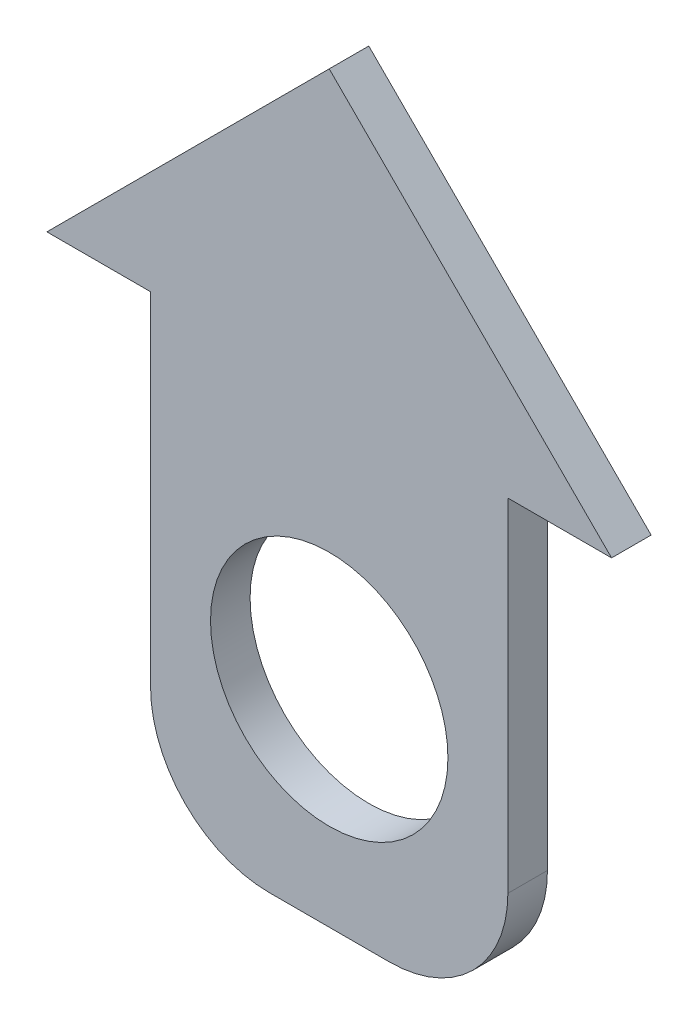
ISO-10303-21;
HEADER;
FILE_DESCRIPTION(('STEP AP214'),'2;1');
FILE_NAME('part.step','',(''),(''),'','','');
FILE_SCHEMA(('AUTOMOTIVE_DESIGN { 1 0 10303 214 1 1 1 1 }'));
ENDSEC;
DATA;
#1=APPLICATION_CONTEXT('core data for automotive mechanical design processes');
#2=APPLICATION_PROTOCOL_DEFINITION('international standard','automotive_design',2000,#1);
#3=PRODUCT_CONTEXT('',#1,'mechanical');
#4=PRODUCT('Part','Part','',(#3));
#5=PRODUCT_RELATED_PRODUCT_CATEGORY('part','',(#4));
#6=PRODUCT_DEFINITION_FORMATION('','',#4);
#7=PRODUCT_DEFINITION_CONTEXT('part definition',#1,'design');
#8=PRODUCT_DEFINITION('design','',#6,#7);
#9=PRODUCT_DEFINITION_SHAPE('','',#8);
#10=(LENGTH_UNIT() NAMED_UNIT(*) SI_UNIT(.MILLI.,.METRE.));
#11=(NAMED_UNIT(*) PLANE_ANGLE_UNIT() SI_UNIT($,.RADIAN.));
#12=(NAMED_UNIT(*) SI_UNIT($,.STERADIAN.) SOLID_ANGLE_UNIT());
#13=UNCERTAINTY_MEASURE_WITH_UNIT(LENGTH_MEASURE(1.E-05),#10,'distance_accuracy_value','');
#14=(GEOMETRIC_REPRESENTATION_CONTEXT(3) GLOBAL_UNCERTAINTY_ASSIGNED_CONTEXT((#13)) GLOBAL_UNIT_ASSIGNED_CONTEXT((#10,
#11,#12)) REPRESENTATION_CONTEXT('',''));
#15=CARTESIAN_POINT('',(0.,0.,0.));
#16=DIRECTION('',(0.,0.,1.));
#17=DIRECTION('',(1.,0.,0.));
#18=AXIS2_PLACEMENT_3D('',#15,#16,#17);
#19=CARTESIAN_POINT('',(0.,0.,1.));
#20=DIRECTION('',(0.,0.,-1.));
#21=DIRECTION('',(-1.,0.,0.));
#22=AXIS2_PLACEMENT_3D('',#19,#20,#21);
#23=PLANE('',#22);
#24=DIRECTION('',(0.,-1.,0.));
#25=VECTOR('',#24,1.);
#26=CARTESIAN_POINT('',(-4.51505590680133,6.44279873715326,1.));
#27=LINE('',#26,#25);
#28=CARTESIAN_POINT('',(-4.51505590680133,6.44279873715326,1.));
#29=VERTEX_POINT('',#28);
#30=CARTESIAN_POINT('',(-4.51505590680133,-2.20796863492381,1.));
#31=VERTEX_POINT('',#30);
#32=EDGE_CURVE('E185',#29,#31,#27,.T.);
#33=ORIENTED_EDGE('',*,*,#32,.T.);
#34=CARTESIAN_POINT('',(-1.51505590680133,-2.20796863492381,1.));
#35=DIRECTION('',(0.,0.,-1.));
#36=DIRECTION('',(-1.,0.,0.));
#37=AXIS2_PLACEMENT_3D('',#34,#35,#36);
#38=CIRCLE('',#37,3.);
#39=CARTESIAN_POINT('',(-1.51505590680133,-5.20796863492381,1.));
#40=VERTEX_POINT('',#39);
#41=EDGE_CURVE('E45',#31,#40,#38,.F.);
#42=ORIENTED_EDGE('',*,*,#41,.T.);
#43=DIRECTION('',(1.,0.,0.));
#44=VECTOR('',#43,1.);
#45=CARTESIAN_POINT('',(-4.51505590680133,-5.20796863492381,1.));
#46=LINE('',#45,#44);
#47=CARTESIAN_POINT('',(1.51505590680133,-5.20796863492381,1.));
#48=VERTEX_POINT('',#47);
#49=EDGE_CURVE('E188',#40,#48,#46,.T.);
#50=ORIENTED_EDGE('',*,*,#49,.T.);
#51=CARTESIAN_POINT('',(1.51505590680133,-2.20796863492381,1.));
#52=DIRECTION('',(0.,0.,-1.));
#53=DIRECTION('',(-1.,0.,0.));
#54=AXIS2_PLACEMENT_3D('',#51,#52,#53);
#55=CIRCLE('',#54,3.);
#56=CARTESIAN_POINT('',(4.51505590680133,-2.20796863492381,1.));
#57=VERTEX_POINT('',#56);
#58=EDGE_CURVE('E60',#48,#57,#55,.F.);
#59=ORIENTED_EDGE('',*,*,#58,.T.);
#60=DIRECTION('',(0.,1.,0.));
#61=VECTOR('',#60,1.);
#62=CARTESIAN_POINT('',(4.51505590680133,-5.20796863492381,1.));
#63=LINE('',#62,#61);
#64=CARTESIAN_POINT('',(4.51505590680133,6.44279873715319,1.));
#65=VERTEX_POINT('',#64);
#66=EDGE_CURVE('E174',#57,#65,#63,.T.);
#67=ORIENTED_EDGE('',*,*,#66,.T.);
#68=DIRECTION('',(1.,0.,0.));
#69=VECTOR('',#68,1.);
#70=CARTESIAN_POINT('',(4.51505590680133,6.44279873715319,1.));
#71=LINE('',#70,#69);
#72=CARTESIAN_POINT('',(7.13571146527562,6.44279873715319,1.));
#73=VERTEX_POINT('',#72);
#74=EDGE_CURVE('E176',#65,#73,#71,.T.);
#75=ORIENTED_EDGE('',*,*,#74,.T.);
#76=DIRECTION('',(-0.707106781186548,0.707106781186547,0.));
#77=VECTOR('',#76,1.);
#78=CARTESIAN_POINT('',(7.13571146527562,6.44279873715319,1.));
#79=LINE('',#78,#77);
#80=CARTESIAN_POINT('',(0.,13.5785102024288,1.));
#81=VERTEX_POINT('',#80);
#82=EDGE_CURVE('E179',#73,#81,#79,.T.);
#83=ORIENTED_EDGE('',*,*,#82,.T.);
#84=DIRECTION('',(-0.707106781186548,-0.707106781186548,0.));
#85=VECTOR('',#84,1.);
#86=CARTESIAN_POINT('',(0.,13.5785102024288,1.));
#87=LINE('',#86,#85);
#88=CARTESIAN_POINT('',(-7.13571146527547,6.44279873715326,1.));
#89=VERTEX_POINT('',#88);
#90=EDGE_CURVE('E181',#81,#89,#87,.T.);
#91=ORIENTED_EDGE('',*,*,#90,.T.);
#92=DIRECTION('',(1.,0.,0.));
#93=VECTOR('',#92,1.);
#94=CARTESIAN_POINT('',(-7.13571146527547,6.44279873715326,1.));
#95=LINE('',#94,#93);
#96=EDGE_CURVE('E183',#89,#29,#95,.T.);
#97=ORIENTED_EDGE('',*,*,#96,.T.);
#98=EDGE_LOOP('',(#33,#42,#50,#59,#67,#75,#83,#91,#97));
#99=FACE_BOUND('',#98,.T.);
#100=CARTESIAN_POINT('',(0.,0.,1.));
#101=DIRECTION('',(0.,0.,1.));
#102=DIRECTION('',(1.,0.,0.));
#103=AXIS2_PLACEMENT_3D('',#100,#101,#102);
#104=CIRCLE('',#103,3.);
#105=CARTESIAN_POINT('',(3.,0.,1.));
#106=VERTEX_POINT('',#105);
#107=EDGE_CURVE('E168',#106,#106,#104,.T.);
#108=ORIENTED_EDGE('',*,*,#107,.F.);
#109=EDGE_LOOP('',(#108));
#110=FACE_BOUND('',#109,.T.);
#111=ADVANCED_FACE('F37',(#99,#110),#23,.F.);
#112=CARTESIAN_POINT('',(0.,0.,0.));
#113=DIRECTION('',(0.,0.,-1.));
#114=DIRECTION('',(-1.,0.,0.));
#115=AXIS2_PLACEMENT_3D('',#112,#113,#114);
#116=PLANE('',#115);
#117=DIRECTION('',(0.,1.,0.));
#118=VECTOR('',#117,1.);
#119=CARTESIAN_POINT('',(-1.00000000000005,0.,0.));
#120=LINE('',#119,#118);
#121=CARTESIAN_POINT('',(-1.,2.82842712474619,0.));
#122=VERTEX_POINT('',#121);
#123=CARTESIAN_POINT('',(-0.99999999999998,4.21011769283229,0.));
#124=VERTEX_POINT('',#123);
#125=EDGE_CURVE('E149',#122,#124,#120,.T.);
#126=ORIENTED_EDGE('',*,*,#125,.F.);
#127=CARTESIAN_POINT('',(0.,0.,0.));
#128=DIRECTION('',(0.,0.,1.));
#129=DIRECTION('',(1.,0.,0.));
#130=AXIS2_PLACEMENT_3D('',#127,#128,#129);
#131=CIRCLE('',#130,3.);
#132=CARTESIAN_POINT('',(1.,2.82842712474619,0.));
#133=VERTEX_POINT('',#132);
#134=EDGE_CURVE('E139',#122,#133,#131,.T.);
#135=ORIENTED_EDGE('',*,*,#134,.T.);
#136=DIRECTION('',(0.,1.,0.));
#137=VECTOR('',#136,1.);
#138=CARTESIAN_POINT('',(1.,0.,0.));
#139=LINE('',#138,#137);
#140=CARTESIAN_POINT('',(1.,4.21011769283227,0.));
#141=VERTEX_POINT('',#140);
#142=EDGE_CURVE('E160',#133,#141,#139,.T.);
#143=ORIENTED_EDGE('',*,*,#142,.T.);
#144=DIRECTION('',(-1.,0.,0.));
#145=VECTOR('',#144,1.);
#146=CARTESIAN_POINT('',(0.,4.21011769283228,0.));
#147=LINE('',#146,#145);
#148=EDGE_CURVE('E52',#141,#124,#147,.T.);
#149=ORIENTED_EDGE('',*,*,#148,.T.);
#150=EDGE_LOOP('',(#126,#135,#143,#149));
#151=FACE_BOUND('',#150,.T.);
#152=DIRECTION('',(1.,0.,0.));
#153=VECTOR('',#152,1.);
#154=CARTESIAN_POINT('',(-4.51505590680133,-5.20796863492381,0.));
#155=LINE('',#154,#153);
#156=CARTESIAN_POINT('',(-1.51505590680133,-5.20796863492381,0.));
#157=VERTEX_POINT('',#156);
#158=CARTESIAN_POINT('',(1.51505590680133,-5.20796863492381,0.));
#159=VERTEX_POINT('',#158);
#160=EDGE_CURVE('E177',#157,#159,#155,.T.);
#161=ORIENTED_EDGE('',*,*,#160,.F.);
#162=CARTESIAN_POINT('',(-1.51505590680133,-2.20796863492381,0.));
#163=DIRECTION('',(0.,0.,-1.));
#164=DIRECTION('',(-1.,0.,0.));
#165=AXIS2_PLACEMENT_3D('',#162,#163,#164);
#166=CIRCLE('',#165,3.);
#167=CARTESIAN_POINT('',(-4.51505590680133,-2.20796863492381,0.));
#168=VERTEX_POINT('',#167);
#169=EDGE_CURVE('E226',#157,#168,#166,.T.);
#170=ORIENTED_EDGE('',*,*,#169,.T.);
#171=DIRECTION('',(0.,-1.,0.));
#172=VECTOR('',#171,1.);
#173=CARTESIAN_POINT('',(-4.51505590680133,6.44279873715326,0.));
#174=LINE('',#173,#172);
#175=CARTESIAN_POINT('',(-4.51505590680133,6.44279873715326,0.));
#176=VERTEX_POINT('',#175);
#177=EDGE_CURVE('E200',#176,#168,#174,.T.);
#178=ORIENTED_EDGE('',*,*,#177,.F.);
#179=DIRECTION('',(1.,0.,0.));
#180=VECTOR('',#179,1.);
#181=CARTESIAN_POINT('',(-7.13571146527547,6.44279873715326,0.));
#182=LINE('',#181,#180);
#183=CARTESIAN_POINT('',(-7.13571146527547,6.44279873715326,0.));
#184=VERTEX_POINT('',#183);
#185=EDGE_CURVE('E198',#184,#176,#182,.T.);
#186=ORIENTED_EDGE('',*,*,#185,.F.);
#187=DIRECTION('',(-0.707106781186548,-0.707106781186548,0.));
#188=VECTOR('',#187,1.);
#189=CARTESIAN_POINT('',(0.,13.5785102024288,0.));
#190=LINE('',#189,#188);
#191=CARTESIAN_POINT('',(0.,13.5785102024288,0.));
#192=VERTEX_POINT('',#191);
#193=EDGE_CURVE('E196',#192,#184,#190,.T.);
#194=ORIENTED_EDGE('',*,*,#193,.F.);
#195=DIRECTION('',(-0.707106781186548,0.707106781186547,0.));
#196=VECTOR('',#195,1.);
#197=CARTESIAN_POINT('',(7.13571146527562,6.44279873715319,0.));
#198=LINE('',#197,#196);
#199=CARTESIAN_POINT('',(7.13571146527562,6.44279873715319,0.));
#200=VERTEX_POINT('',#199);
#201=EDGE_CURVE('E194',#200,#192,#198,.T.);
#202=ORIENTED_EDGE('',*,*,#201,.F.);
#203=DIRECTION('',(1.,0.,0.));
#204=VECTOR('',#203,1.);
#205=CARTESIAN_POINT('',(4.51505590680133,6.44279873715319,0.));
#206=LINE('',#205,#204);
#207=CARTESIAN_POINT('',(4.51505590680133,6.44279873715319,0.));
#208=VERTEX_POINT('',#207);
#209=EDGE_CURVE('E192',#208,#200,#206,.T.);
#210=ORIENTED_EDGE('',*,*,#209,.F.);
#211=DIRECTION('',(0.,1.,0.));
#212=VECTOR('',#211,1.);
#213=CARTESIAN_POINT('',(4.51505590680133,-5.20796863492381,0.));
#214=LINE('',#213,#212);
#215=CARTESIAN_POINT('',(4.51505590680133,-2.20796863492381,0.));
#216=VERTEX_POINT('',#215);
#217=EDGE_CURVE('E171',#216,#208,#214,.T.);
#218=ORIENTED_EDGE('',*,*,#217,.F.);
#219=CARTESIAN_POINT('',(1.51505590680133,-2.20796863492381,0.));
#220=DIRECTION('',(0.,0.,-1.));
#221=DIRECTION('',(-1.,0.,0.));
#222=AXIS2_PLACEMENT_3D('',#219,#220,#221);
#223=CIRCLE('',#222,3.);
#224=EDGE_CURVE('E224',#216,#159,#223,.T.);
#225=ORIENTED_EDGE('',*,*,#224,.T.);
#226=EDGE_LOOP('',(#161,#170,#178,#186,#194,#202,#210,#218,#225));
#227=FACE_BOUND('',#226,.T.);
#228=ADVANCED_FACE('F244',(#151,#227),#116,.T.);
#229=CARTESIAN_POINT('',(4.51505590680133,-5.20796863492381,1.));
#230=DIRECTION('',(-1.,0.,0.));
#231=DIRECTION('',(0.,0.,1.));
#232=AXIS2_PLACEMENT_3D('',#229,#230,#231);
#233=PLANE('',#232);
#234=ORIENTED_EDGE('',*,*,#66,.F.);
#235=DIRECTION('',(0.,0.,-1.));
#236=VECTOR('',#235,1.);
#237=CARTESIAN_POINT('',(4.51505590680133,-2.20796863492381,1.));
#238=LINE('',#237,#236);
#239=EDGE_CURVE('E11',#57,#216,#238,.T.);
#240=ORIENTED_EDGE('',*,*,#239,.T.);
#241=ORIENTED_EDGE('',*,*,#217,.T.);
#242=DIRECTION('',(0.,0.,-1.));
#243=VECTOR('',#242,1.);
#244=CARTESIAN_POINT('',(4.51505590680133,6.44279873715319,1.));
#245=LINE('',#244,#243);
#246=EDGE_CURVE('E216',#65,#208,#245,.T.);
#247=ORIENTED_EDGE('',*,*,#246,.F.);
#248=EDGE_LOOP('',(#234,#240,#241,#247));
#249=FACE_BOUND('',#248,.T.);
#250=ADVANCED_FACE('F270',(#249),#233,.F.);
#251=CARTESIAN_POINT('',(4.51505590680133,6.44279873715319,1.));
#252=DIRECTION('',(0.,1.,0.));
#253=DIRECTION('',(0.,0.,1.));
#254=AXIS2_PLACEMENT_3D('',#251,#252,#253);
#255=PLANE('',#254);
#256=ORIENTED_EDGE('',*,*,#209,.T.);
#257=DIRECTION('',(0.,0.,-1.));
#258=VECTOR('',#257,1.);
#259=CARTESIAN_POINT('',(7.13571146527562,6.44279873715319,1.));
#260=LINE('',#259,#258);
#261=EDGE_CURVE('E213',#73,#200,#260,.T.);
#262=ORIENTED_EDGE('',*,*,#261,.F.);
#263=ORIENTED_EDGE('',*,*,#74,.F.);
#264=ORIENTED_EDGE('',*,*,#246,.T.);
#265=EDGE_LOOP('',(#256,#262,#263,#264));
#266=FACE_BOUND('',#265,.T.);
#267=ADVANCED_FACE('F266',(#266),#255,.F.);
#268=CARTESIAN_POINT('',(7.13571146527562,6.44279873715319,1.));
#269=DIRECTION('',(-0.707106781186547,-0.707106781186548,0.));
#270=DIRECTION('',(0.707106781186548,-0.707106781186547,0.));
#271=AXIS2_PLACEMENT_3D('',#268,#269,#270);
#272=PLANE('',#271);
#273=ORIENTED_EDGE('',*,*,#201,.T.);
#274=DIRECTION('',(0.,0.,-1.));
#275=VECTOR('',#274,1.);
#276=CARTESIAN_POINT('',(0.,13.5785102024288,1.));
#277=LINE('',#276,#275);
#278=EDGE_CURVE('E210',#81,#192,#277,.T.);
#279=ORIENTED_EDGE('',*,*,#278,.F.);
#280=ORIENTED_EDGE('',*,*,#82,.F.);
#281=ORIENTED_EDGE('',*,*,#261,.T.);
#282=EDGE_LOOP('',(#273,#279,#280,#281));
#283=FACE_BOUND('',#282,.T.);
#284=ADVANCED_FACE('F262',(#283),#272,.F.);
#285=CARTESIAN_POINT('',(0.,13.5785102024288,1.));
#286=DIRECTION('',(0.707106781186547,-0.707106781186547,0.));
#287=DIRECTION('',(0.707106781186548,0.707106781186548,0.));
#288=AXIS2_PLACEMENT_3D('',#285,#286,#287);
#289=PLANE('',#288);
#290=ORIENTED_EDGE('',*,*,#193,.T.);
#291=DIRECTION('',(0.,0.,-1.));
#292=VECTOR('',#291,1.);
#293=CARTESIAN_POINT('',(-7.13571146527547,6.44279873715326,1.));
#294=LINE('',#293,#292);
#295=EDGE_CURVE('E207',#89,#184,#294,.T.);
#296=ORIENTED_EDGE('',*,*,#295,.F.);
#297=ORIENTED_EDGE('',*,*,#90,.F.);
#298=ORIENTED_EDGE('',*,*,#278,.T.);
#299=EDGE_LOOP('',(#290,#296,#297,#298));
#300=FACE_BOUND('',#299,.T.);
#301=ADVANCED_FACE('F257',(#300),#289,.F.);
#302=CARTESIAN_POINT('',(-7.13571146527547,6.44279873715326,1.));
#303=DIRECTION('',(0.,1.,0.));
#304=DIRECTION('',(0.,0.,1.));
#305=AXIS2_PLACEMENT_3D('',#302,#303,#304);
#306=PLANE('',#305);
#307=ORIENTED_EDGE('',*,*,#185,.T.);
#308=DIRECTION('',(0.,0.,-1.));
#309=VECTOR('',#308,1.);
#310=CARTESIAN_POINT('',(-4.51505590680133,6.44279873715326,1.));
#311=LINE('',#310,#309);
#312=EDGE_CURVE('E190',#29,#176,#311,.T.);
#313=ORIENTED_EDGE('',*,*,#312,.F.);
#314=ORIENTED_EDGE('',*,*,#96,.F.);
#315=ORIENTED_EDGE('',*,*,#295,.T.);
#316=EDGE_LOOP('',(#307,#313,#314,#315));
#317=FACE_BOUND('',#316,.T.);
#318=ADVANCED_FACE('F251',(#317),#306,.F.);
#319=CARTESIAN_POINT('',(-4.51505590680133,6.44279873715326,1.));
#320=DIRECTION('',(1.,0.,0.));
#321=DIRECTION('',(0.,1.,0.));
#322=AXIS2_PLACEMENT_3D('',#319,#320,#321);
#323=PLANE('',#322);
#324=ORIENTED_EDGE('',*,*,#177,.T.);
#325=DIRECTION('',(0.,0.,-1.));
#326=VECTOR('',#325,1.);
#327=CARTESIAN_POINT('',(-4.51505590680133,-2.20796863492381,1.));
#328=LINE('',#327,#326);
#329=EDGE_CURVE('E228',#168,#31,#328,.F.);
#330=ORIENTED_EDGE('',*,*,#329,.T.);
#331=ORIENTED_EDGE('',*,*,#32,.F.);
#332=ORIENTED_EDGE('',*,*,#312,.T.);
#333=EDGE_LOOP('',(#324,#330,#331,#332));
#334=FACE_BOUND('',#333,.T.);
#335=ADVANCED_FACE('F247',(#334),#323,.F.);
#336=CARTESIAN_POINT('',(-4.51505590680133,-5.20796863492381,1.));
#337=DIRECTION('',(0.,1.,0.));
#338=DIRECTION('',(-1.,0.,0.));
#339=AXIS2_PLACEMENT_3D('',#336,#337,#338);
#340=PLANE('',#339);
#341=ORIENTED_EDGE('',*,*,#49,.F.);
#342=DIRECTION('',(0.,0.,-1.));
#343=VECTOR('',#342,1.);
#344=CARTESIAN_POINT('',(-1.51505590680133,-5.20796863492381,1.));
#345=LINE('',#344,#343);
#346=EDGE_CURVE('E221',#40,#157,#345,.T.);
#347=ORIENTED_EDGE('',*,*,#346,.T.);
#348=ORIENTED_EDGE('',*,*,#160,.T.);
#349=DIRECTION('',(0.,0.,-1.));
#350=VECTOR('',#349,1.);
#351=CARTESIAN_POINT('',(1.51505590680133,-5.20796863492381,1.));
#352=LINE('',#351,#350);
#353=EDGE_CURVE('E219',#159,#48,#352,.F.);
#354=ORIENTED_EDGE('',*,*,#353,.T.);
#355=EDGE_LOOP('',(#341,#347,#348,#354));
#356=FACE_BOUND('',#355,.T.);
#357=ADVANCED_FACE('F238',(#356),#340,.F.);
#358=CARTESIAN_POINT('',(0.,0.,1.));
#359=DIRECTION('',(0.,0.,-1.));
#360=DIRECTION('',(-1.,0.,0.));
#361=AXIS2_PLACEMENT_3D('',#358,#359,#360);
#362=CYLINDRICAL_SURFACE('',#361,3.);
#363=ORIENTED_EDGE('',*,*,#107,.T.);
#364=EDGE_LOOP('',(#363));
#365=FACE_BOUND('',#364,.T.);
#366=ORIENTED_EDGE('',*,*,#134,.F.);
#367=DIRECTION('',(0.,0.,1.));
#368=VECTOR('',#367,1.);
#369=CARTESIAN_POINT('',(-1.,2.82842712474619,-1.));
#370=LINE('',#369,#368);
#371=CARTESIAN_POINT('',(-1.,2.82842712474619,-1.));
#372=VERTEX_POINT('',#371);
#373=EDGE_CURVE('E165',#372,#122,#370,.T.);
#374=ORIENTED_EDGE('',*,*,#373,.F.);
#375=CARTESIAN_POINT('',(0.,0.,-1.));
#376=DIRECTION('',(0.,0.,-1.));
#377=DIRECTION('',(-1.,0.,0.));
#378=AXIS2_PLACEMENT_3D('',#375,#376,#377);
#379=CIRCLE('',#378,3.);
#380=CARTESIAN_POINT('',(1.,2.82842712474619,-1.));
#381=VERTEX_POINT('',#380);
#382=EDGE_CURVE('E153',#381,#372,#379,.F.);
#383=ORIENTED_EDGE('',*,*,#382,.F.);
#384=DIRECTION('',(0.,0.,1.));
#385=VECTOR('',#384,1.);
#386=CARTESIAN_POINT('',(1.,2.82842712474619,-1.));
#387=LINE('',#386,#385);
#388=EDGE_CURVE('E140',#381,#133,#387,.T.);
#389=ORIENTED_EDGE('',*,*,#388,.T.);
#390=EDGE_LOOP('',(#366,#374,#383,#389));
#391=FACE_BOUND('',#390,.T.);
#392=ADVANCED_FACE('F280',(#365,#391),#362,.F.);
#393=CARTESIAN_POINT('',(-1.51505590680133,-2.20796863492381,1.));
#394=DIRECTION('',(0.,0.,-1.));
#395=DIRECTION('',(-1.,0.,0.));
#396=AXIS2_PLACEMENT_3D('',#393,#394,#395);
#397=CYLINDRICAL_SURFACE('',#396,3.);
#398=ORIENTED_EDGE('',*,*,#41,.F.);
#399=ORIENTED_EDGE('',*,*,#329,.F.);
#400=ORIENTED_EDGE('',*,*,#169,.F.);
#401=ORIENTED_EDGE('',*,*,#346,.F.);
#402=EDGE_LOOP('',(#398,#399,#400,#401));
#403=FACE_BOUND('',#402,.T.);
#404=ADVANCED_FACE('F241',(#403),#397,.T.);
#405=CARTESIAN_POINT('',(1.51505590680133,-2.20796863492381,1.));
#406=DIRECTION('',(0.,0.,-1.));
#407=DIRECTION('',(-1.,0.,0.));
#408=AXIS2_PLACEMENT_3D('',#405,#406,#407);
#409=CYLINDRICAL_SURFACE('',#408,3.);
#410=ORIENTED_EDGE('',*,*,#58,.F.);
#411=ORIENTED_EDGE('',*,*,#353,.F.);
#412=ORIENTED_EDGE('',*,*,#224,.F.);
#413=ORIENTED_EDGE('',*,*,#239,.F.);
#414=EDGE_LOOP('',(#410,#411,#412,#413));
#415=FACE_BOUND('',#414,.T.);
#416=ADVANCED_FACE('F39',(#415),#409,.T.);
#417=CARTESIAN_POINT('',(0.,4.21011769283228,-1.));
#418=DIRECTION('',(0.,1.,0.));
#419=DIRECTION('',(-1.,0.,0.));
#420=AXIS2_PLACEMENT_3D('',#417,#418,#419);
#421=PLANE('',#420);
#422=ORIENTED_EDGE('',*,*,#148,.F.);
#423=DIRECTION('',(0.,0.,1.));
#424=VECTOR('',#423,1.);
#425=CARTESIAN_POINT('',(1.,4.21011769283227,-1.));
#426=LINE('',#425,#424);
#427=CARTESIAN_POINT('',(1.,4.21011769283227,-1.));
#428=VERTEX_POINT('',#427);
#429=EDGE_CURVE('E131',#428,#141,#426,.T.);
#430=ORIENTED_EDGE('',*,*,#429,.F.);
#431=DIRECTION('',(-1.,0.,0.));
#432=VECTOR('',#431,1.);
#433=CARTESIAN_POINT('',(0.,4.21011769283228,-1.));
#434=LINE('',#433,#432);
#435=CARTESIAN_POINT('',(-0.99999999999998,4.21011769283229,-1.));
#436=VERTEX_POINT('',#435);
#437=EDGE_CURVE('E134',#428,#436,#434,.T.);
#438=ORIENTED_EDGE('',*,*,#437,.T.);
#439=DIRECTION('',(0.,0.,1.));
#440=VECTOR('',#439,1.);
#441=CARTESIAN_POINT('',(-0.99999999999998,4.21011769283229,-1.));
#442=LINE('',#441,#440);
#443=EDGE_CURVE('E158',#436,#124,#442,.T.);
#444=ORIENTED_EDGE('',*,*,#443,.T.);
#445=EDGE_LOOP('',(#422,#430,#438,#444));
#446=FACE_BOUND('',#445,.T.);
#447=ADVANCED_FACE('F133',(#446),#421,.T.);
#448=CARTESIAN_POINT('',(1.,0.,-1.));
#449=DIRECTION('',(1.,0.,0.));
#450=DIRECTION('',(0.,0.,-1.));
#451=AXIS2_PLACEMENT_3D('',#448,#449,#450);
#452=PLANE('',#451);
#453=ORIENTED_EDGE('',*,*,#142,.F.);
#454=ORIENTED_EDGE('',*,*,#388,.F.);
#455=DIRECTION('',(0.,1.,0.));
#456=VECTOR('',#455,1.);
#457=CARTESIAN_POINT('',(1.,0.,-1.));
#458=LINE('',#457,#456);
#459=EDGE_CURVE('E145',#381,#428,#458,.T.);
#460=ORIENTED_EDGE('',*,*,#459,.T.);
#461=ORIENTED_EDGE('',*,*,#429,.T.);
#462=EDGE_LOOP('',(#453,#454,#460,#461));
#463=FACE_BOUND('',#462,.T.);
#464=ADVANCED_FACE('F151',(#463),#452,.T.);
#465=CARTESIAN_POINT('',(-1.00000000000005,0.,-1.));
#466=DIRECTION('',(1.,0.,0.));
#467=DIRECTION('',(0.,1.,0.));
#468=AXIS2_PLACEMENT_3D('',#465,#466,#467);
#469=PLANE('',#468);
#470=ORIENTED_EDGE('',*,*,#125,.T.);
#471=ORIENTED_EDGE('',*,*,#443,.F.);
#472=DIRECTION('',(0.,1.,0.));
#473=VECTOR('',#472,1.);
#474=CARTESIAN_POINT('',(-1.00000000000005,0.,-1.));
#475=LINE('',#474,#473);
#476=EDGE_CURVE('E147',#372,#436,#475,.T.);
#477=ORIENTED_EDGE('',*,*,#476,.F.);
#478=ORIENTED_EDGE('',*,*,#373,.T.);
#479=EDGE_LOOP('',(#470,#471,#477,#478));
#480=FACE_BOUND('',#479,.T.);
#481=ADVANCED_FACE('F365',(#480),#469,.F.);
#482=CARTESIAN_POINT('',(0.,0.,-1.));
#483=DIRECTION('',(0.,0.,-1.));
#484=DIRECTION('',(-1.,0.,0.));
#485=AXIS2_PLACEMENT_3D('',#482,#483,#484);
#486=PLANE('',#485);
#487=ORIENTED_EDGE('',*,*,#437,.F.);
#488=ORIENTED_EDGE('',*,*,#459,.F.);
#489=ORIENTED_EDGE('',*,*,#382,.T.);
#490=ORIENTED_EDGE('',*,*,#476,.T.);
#491=EDGE_LOOP('',(#487,#488,#489,#490));
#492=FACE_BOUND('',#491,.T.);
#493=ADVANCED_FACE('F144',(#492),#486,.T.);
#494=CLOSED_SHELL('',(#111,#228,#250,#267,#284,#301,#318,#335,#357,#392,#404,#416,#447,#464,
#481,#493));
#495=MANIFOLD_SOLID_BREP('B2',#494);
#496=ADVANCED_BREP_SHAPE_REPRESENTATION('',(#18,#495),#14);
#497=SHAPE_DEFINITION_REPRESENTATION(#9,#496);
ENDSEC;
END-ISO-10303-21;
